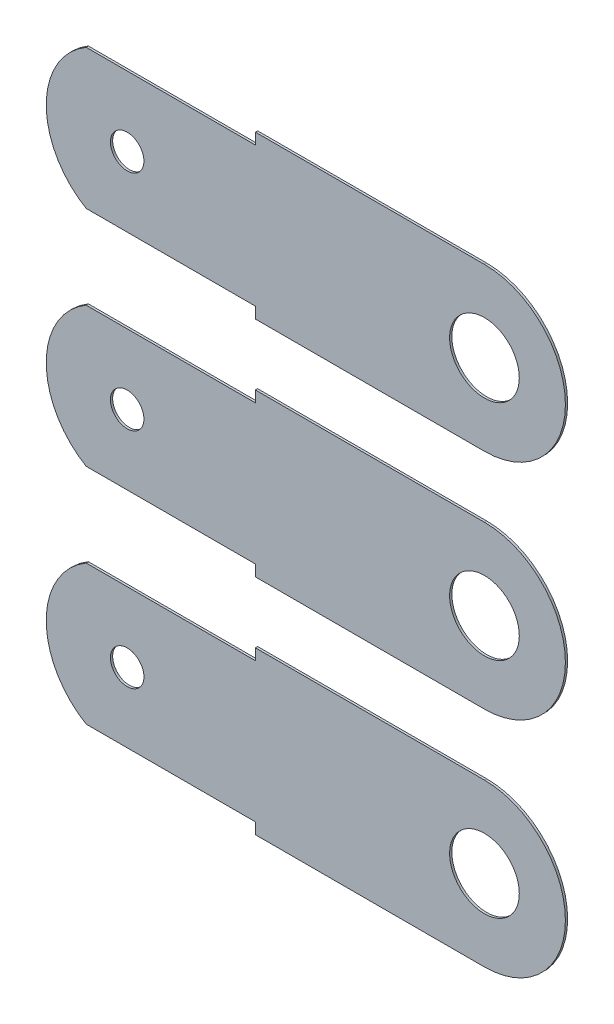
ISO-10303-21;
HEADER;
FILE_DESCRIPTION(('STEP AP214'),'2;1');
FILE_NAME('part.step','',(''),(''),'','','');
FILE_SCHEMA(('AUTOMOTIVE_DESIGN { 1 0 10303 214 1 1 1 1 }'));
ENDSEC;
DATA;
#1=APPLICATION_CONTEXT('core data for automotive mechanical design processes');
#2=APPLICATION_PROTOCOL_DEFINITION('international standard','automotive_design',2000,#1);
#3=PRODUCT_CONTEXT('',#1,'mechanical');
#4=PRODUCT('Part','Part','',(#3));
#5=PRODUCT_RELATED_PRODUCT_CATEGORY('part','',(#4));
#6=PRODUCT_DEFINITION_FORMATION('','',#4);
#7=PRODUCT_DEFINITION_CONTEXT('part definition',#1,'design');
#8=PRODUCT_DEFINITION('design','',#6,#7);
#9=PRODUCT_DEFINITION_SHAPE('','',#8);
#10=(LENGTH_UNIT() NAMED_UNIT(*) SI_UNIT(.MILLI.,.METRE.));
#11=(NAMED_UNIT(*) PLANE_ANGLE_UNIT() SI_UNIT($,.RADIAN.));
#12=(NAMED_UNIT(*) SI_UNIT($,.STERADIAN.) SOLID_ANGLE_UNIT());
#13=UNCERTAINTY_MEASURE_WITH_UNIT(LENGTH_MEASURE(1.E-05),#10,'distance_accuracy_value','');
#14=(GEOMETRIC_REPRESENTATION_CONTEXT(3) GLOBAL_UNCERTAINTY_ASSIGNED_CONTEXT((#13)) GLOBAL_UNIT_ASSIGNED_CONTEXT((#10,
#11,#12)) REPRESENTATION_CONTEXT('',''));
#15=CARTESIAN_POINT('',(0.,0.,0.));
#16=DIRECTION('',(0.,0.,1.));
#17=DIRECTION('',(1.,0.,0.));
#18=AXIS2_PLACEMENT_3D('',#15,#16,#17);
#19=CARTESIAN_POINT('',(-9.906,-5.08,0.0508));
#20=DIRECTION('',(0.,0.,1.));
#21=DIRECTION('',(1.,0.,0.));
#22=AXIS2_PLACEMENT_3D('',#19,#20,#21);
#23=PLANE('',#22);
#24=DIRECTION('',(0.,1.,0.));
#25=VECTOR('',#24,1.);
#26=CARTESIAN_POINT('',(-15.1194460576051,-6.6675,0.0508));
#27=LINE('',#26,#25);
#28=CARTESIAN_POINT('',(-15.1194460576051,-6.9215,0.0508));
#29=VERTEX_POINT('',#28);
#30=CARTESIAN_POINT('',(-15.1194460576051,-6.6675,0.0508));
#31=VERTEX_POINT('',#30);
#32=EDGE_CURVE('E110',#29,#31,#27,.T.);
#33=ORIENTED_EDGE('',*,*,#32,.F.);
#34=DIRECTION('',(1.,0.,0.));
#35=VECTOR('',#34,1.);
#36=CARTESIAN_POINT('',(-9.906,-6.9215,0.0508));
#37=LINE('',#36,#35);
#38=CARTESIAN_POINT('',(-9.906,-6.9215,0.0508));
#39=VERTEX_POINT('',#38);
#40=EDGE_CURVE('E164',#29,#39,#37,.T.);
#41=ORIENTED_EDGE('',*,*,#40,.T.);
#42=CARTESIAN_POINT('',(-9.906,-5.08,0.0508));
#43=DIRECTION('',(0.,0.,1.));
#44=DIRECTION('',(1.,0.,0.));
#45=AXIS2_PLACEMENT_3D('',#42,#43,#44);
#46=CIRCLE('',#45,1.8415);
#47=CARTESIAN_POINT('',(-9.906,-3.2385,0.0508));
#48=VERTEX_POINT('',#47);
#49=EDGE_CURVE('E155',#39,#48,#46,.T.);
#50=ORIENTED_EDGE('',*,*,#49,.T.);
#51=DIRECTION('',(-1.,0.,0.));
#52=VECTOR('',#51,1.);
#53=CARTESIAN_POINT('',(-9.906,-3.2385,0.0508));
#54=LINE('',#53,#52);
#55=CARTESIAN_POINT('',(-15.1174161513952,-3.2385,0.0508));
#56=VERTEX_POINT('',#55);
#57=EDGE_CURVE('E158',#48,#56,#54,.T.);
#58=ORIENTED_EDGE('',*,*,#57,.T.);
#59=DIRECTION('',(0.,1.,0.));
#60=VECTOR('',#59,1.);
#61=CARTESIAN_POINT('',(-15.1174161513952,-2.78009606813962,0.0508));
#62=LINE('',#61,#60);
#63=CARTESIAN_POINT('',(-15.1174161513952,-3.4925,0.0508));
#64=VERTEX_POINT('',#63);
#65=EDGE_CURVE('E134',#64,#56,#62,.T.);
#66=ORIENTED_EDGE('',*,*,#65,.F.);
#67=DIRECTION('',(1.,0.,0.));
#68=VECTOR('',#67,1.);
#69=CARTESIAN_POINT('',(-15.1174161513952,-3.4925,0.0508));
#70=LINE('',#69,#68);
#71=CARTESIAN_POINT('',(-18.9672555920004,-3.4925,0.0508));
#72=VERTEX_POINT('',#71);
#73=EDGE_CURVE('E113',#72,#64,#70,.T.);
#74=ORIENTED_EDGE('',*,*,#73,.F.);
#75=CARTESIAN_POINT('',(-18.034,-5.08,0.0508));
#76=DIRECTION('',(0.,0.,1.));
#77=DIRECTION('',(1.,0.,0.));
#78=AXIS2_PLACEMENT_3D('',#75,#76,#77);
#79=CIRCLE('',#78,1.8415);
#80=CARTESIAN_POINT('',(-18.9672555920004,-6.6675,0.0508));
#81=VERTEX_POINT('',#80);
#82=EDGE_CURVE('E161',#72,#81,#79,.T.);
#83=ORIENTED_EDGE('',*,*,#82,.T.);
#84=DIRECTION('',(-1.,0.,0.));
#85=VECTOR('',#84,1.);
#86=CARTESIAN_POINT('',(-15.1194460576051,-6.6675,0.0508));
#87=LINE('',#86,#85);
#88=EDGE_CURVE('E127',#31,#81,#87,.T.);
#89=ORIENTED_EDGE('',*,*,#88,.F.);
#90=EDGE_LOOP('',(#33,#41,#50,#58,#66,#74,#83,#89));
#91=FACE_BOUND('',#90,.T.);
#92=CARTESIAN_POINT('',(-18.034,-5.08,0.0508));
#93=DIRECTION('',(0.,0.,1.));
#94=DIRECTION('',(1.,0.,0.));
#95=AXIS2_PLACEMENT_3D('',#92,#93,#94);
#96=CIRCLE('',#95,0.380999999999998);
#97=CARTESIAN_POINT('',(-17.653,-5.08,0.0508));
#98=VERTEX_POINT('',#97);
#99=EDGE_CURVE('E149',#98,#98,#96,.T.);
#100=ORIENTED_EDGE('',*,*,#99,.F.);
#101=EDGE_LOOP('',(#100));
#102=FACE_BOUND('',#101,.T.);
#103=CARTESIAN_POINT('',(-9.906,-5.08,0.0508));
#104=DIRECTION('',(0.,0.,1.));
#105=DIRECTION('',(1.,0.,0.));
#106=AXIS2_PLACEMENT_3D('',#103,#104,#105);
#107=CIRCLE('',#106,0.79248);
#108=CARTESIAN_POINT('',(-9.11352,-5.08,0.0508));
#109=VERTEX_POINT('',#108);
#110=EDGE_CURVE('E143',#109,#109,#107,.T.);
#111=ORIENTED_EDGE('',*,*,#110,.F.);
#112=EDGE_LOOP('',(#111));
#113=FACE_BOUND('',#112,.T.);
#114=ADVANCED_FACE('F43',(#91,#102,#113),#23,.T.);
#115=CARTESIAN_POINT('',(-9.906,-5.08,0.));
#116=DIRECTION('',(0.,0.,1.));
#117=DIRECTION('',(1.,0.,0.));
#118=AXIS2_PLACEMENT_3D('',#115,#116,#117);
#119=PLANE('',#118);
#120=DIRECTION('',(1.,0.,0.));
#121=VECTOR('',#120,1.);
#122=CARTESIAN_POINT('',(-9.906,-6.9215,0.));
#123=LINE('',#122,#121);
#124=CARTESIAN_POINT('',(-15.1194460576051,-6.9215,0.));
#125=VERTEX_POINT('',#124);
#126=CARTESIAN_POINT('',(-9.906,-6.9215,0.));
#127=VERTEX_POINT('',#126);
#128=EDGE_CURVE('E126',#125,#127,#123,.T.);
#129=ORIENTED_EDGE('',*,*,#128,.F.);
#130=DIRECTION('',(0.,1.,0.));
#131=VECTOR('',#130,1.);
#132=CARTESIAN_POINT('',(-15.1194460576051,-6.6675,0.));
#133=LINE('',#132,#131);
#134=CARTESIAN_POINT('',(-15.1194460576051,-6.6675,0.));
#135=VERTEX_POINT('',#134);
#136=EDGE_CURVE('E58',#125,#135,#133,.T.);
#137=ORIENTED_EDGE('',*,*,#136,.T.);
#138=DIRECTION('',(-1.,0.,0.));
#139=VECTOR('',#138,1.);
#140=CARTESIAN_POINT('',(-15.1194460576051,-6.6675,0.));
#141=LINE('',#140,#139);
#142=CARTESIAN_POINT('',(-18.9672555920004,-6.6675,0.));
#143=VERTEX_POINT('',#142);
#144=EDGE_CURVE('E114',#135,#143,#141,.T.);
#145=ORIENTED_EDGE('',*,*,#144,.T.);
#146=CARTESIAN_POINT('',(-18.034,-5.08,0.));
#147=DIRECTION('',(0.,0.,1.));
#148=DIRECTION('',(1.,0.,0.));
#149=AXIS2_PLACEMENT_3D('',#146,#147,#148);
#150=CIRCLE('',#149,1.8415);
#151=CARTESIAN_POINT('',(-18.9672555920004,-3.4925,0.));
#152=VERTEX_POINT('',#151);
#153=EDGE_CURVE('E172',#152,#143,#150,.T.);
#154=ORIENTED_EDGE('',*,*,#153,.F.);
#155=DIRECTION('',(1.,0.,0.));
#156=VECTOR('',#155,1.);
#157=CARTESIAN_POINT('',(-15.1174161513952,-3.4925,0.));
#158=LINE('',#157,#156);
#159=CARTESIAN_POINT('',(-15.1174161513952,-3.4925,0.));
#160=VERTEX_POINT('',#159);
#161=EDGE_CURVE('E66',#152,#160,#158,.T.);
#162=ORIENTED_EDGE('',*,*,#161,.T.);
#163=DIRECTION('',(0.,1.,0.));
#164=VECTOR('',#163,1.);
#165=CARTESIAN_POINT('',(-15.1174161513952,-2.78009606813962,0.));
#166=LINE('',#165,#164);
#167=CARTESIAN_POINT('',(-15.1174161513952,-3.2385,0.));
#168=VERTEX_POINT('',#167);
#169=EDGE_CURVE('E133',#160,#168,#166,.T.);
#170=ORIENTED_EDGE('',*,*,#169,.T.);
#171=DIRECTION('',(-1.,0.,0.));
#172=VECTOR('',#171,1.);
#173=CARTESIAN_POINT('',(-9.906,-3.2385,0.));
#174=LINE('',#173,#172);
#175=CARTESIAN_POINT('',(-9.906,-3.2385,0.));
#176=VERTEX_POINT('',#175);
#177=EDGE_CURVE('E169',#176,#168,#174,.T.);
#178=ORIENTED_EDGE('',*,*,#177,.F.);
#179=CARTESIAN_POINT('',(-9.906,-5.08,0.));
#180=DIRECTION('',(0.,0.,1.));
#181=DIRECTION('',(1.,0.,0.));
#182=AXIS2_PLACEMENT_3D('',#179,#180,#181);
#183=CIRCLE('',#182,1.8415);
#184=EDGE_CURVE('E152',#127,#176,#183,.T.);
#185=ORIENTED_EDGE('',*,*,#184,.F.);
#186=EDGE_LOOP('',(#129,#137,#145,#154,#162,#170,#178,#185));
#187=FACE_BOUND('',#186,.T.);
#188=CARTESIAN_POINT('',(-18.034,-5.08,0.));
#189=DIRECTION('',(0.,0.,1.));
#190=DIRECTION('',(1.,0.,0.));
#191=AXIS2_PLACEMENT_3D('',#188,#189,#190);
#192=CIRCLE('',#191,0.380999999999998);
#193=CARTESIAN_POINT('',(-17.653,-5.08,0.));
#194=VERTEX_POINT('',#193);
#195=EDGE_CURVE('E146',#194,#194,#192,.T.);
#196=ORIENTED_EDGE('',*,*,#195,.T.);
#197=EDGE_LOOP('',(#196));
#198=FACE_BOUND('',#197,.T.);
#199=CARTESIAN_POINT('',(-9.906,-5.08,0.));
#200=DIRECTION('',(0.,0.,1.));
#201=DIRECTION('',(1.,0.,0.));
#202=AXIS2_PLACEMENT_3D('',#199,#200,#201);
#203=CIRCLE('',#202,0.79248);
#204=CARTESIAN_POINT('',(-9.11352,-5.08,0.));
#205=VERTEX_POINT('',#204);
#206=EDGE_CURVE('E142',#205,#205,#203,.T.);
#207=ORIENTED_EDGE('',*,*,#206,.T.);
#208=EDGE_LOOP('',(#207));
#209=FACE_BOUND('',#208,.T.);
#210=ADVANCED_FACE('F123',(#187,#198,#209),#119,.F.);
#211=CARTESIAN_POINT('',(-9.906,-5.08,0.0508));
#212=DIRECTION('',(0.,0.,-1.));
#213=DIRECTION('',(-1.,0.,0.));
#214=AXIS2_PLACEMENT_3D('',#211,#212,#213);
#215=CYLINDRICAL_SURFACE('',#214,1.8415);
#216=ORIENTED_EDGE('',*,*,#184,.T.);
#217=DIRECTION('',(0.,0.,-1.));
#218=VECTOR('',#217,1.);
#219=CARTESIAN_POINT('',(-9.906,-3.2385,0.0508));
#220=LINE('',#219,#218);
#221=EDGE_CURVE('E177',#48,#176,#220,.T.);
#222=ORIENTED_EDGE('',*,*,#221,.F.);
#223=ORIENTED_EDGE('',*,*,#49,.F.);
#224=DIRECTION('',(0.,0.,-1.));
#225=VECTOR('',#224,1.);
#226=CARTESIAN_POINT('',(-9.906,-6.9215,0.0508));
#227=LINE('',#226,#225);
#228=EDGE_CURVE('E166',#39,#127,#227,.T.);
#229=ORIENTED_EDGE('',*,*,#228,.T.);
#230=EDGE_LOOP('',(#216,#222,#223,#229));
#231=FACE_BOUND('',#230,.T.);
#232=ADVANCED_FACE('F45',(#231),#215,.T.);
#233=CARTESIAN_POINT('',(-9.906,-3.2385,0.0508));
#234=DIRECTION('',(0.,-1.,0.));
#235=DIRECTION('',(1.,0.,0.));
#236=AXIS2_PLACEMENT_3D('',#233,#234,#235);
#237=PLANE('',#236);
#238=ORIENTED_EDGE('',*,*,#177,.T.);
#239=DIRECTION('',(0.,0.,1.));
#240=VECTOR('',#239,1.);
#241=CARTESIAN_POINT('',(-15.1174161513952,-3.2385,0.0508));
#242=LINE('',#241,#240);
#243=EDGE_CURVE('E182',#168,#56,#242,.T.);
#244=ORIENTED_EDGE('',*,*,#243,.T.);
#245=ORIENTED_EDGE('',*,*,#57,.F.);
#246=ORIENTED_EDGE('',*,*,#221,.T.);
#247=EDGE_LOOP('',(#238,#244,#245,#246));
#248=FACE_BOUND('',#247,.T.);
#249=ADVANCED_FACE('F197',(#248),#237,.F.);
#250=CARTESIAN_POINT('',(-18.034,-5.08,0.0508));
#251=DIRECTION('',(0.,0.,-1.));
#252=DIRECTION('',(-1.,0.,0.));
#253=AXIS2_PLACEMENT_3D('',#250,#251,#252);
#254=CYLINDRICAL_SURFACE('',#253,1.8415);
#255=ORIENTED_EDGE('',*,*,#153,.T.);
#256=DIRECTION('',(0.,0.,-1.));
#257=VECTOR('',#256,1.);
#258=CARTESIAN_POINT('',(-18.9672555920004,-6.6675,0.0508));
#259=LINE('',#258,#257);
#260=EDGE_CURVE('E12',#143,#81,#259,.F.);
#261=ORIENTED_EDGE('',*,*,#260,.T.);
#262=ORIENTED_EDGE('',*,*,#82,.F.);
#263=DIRECTION('',(0.,0.,-1.));
#264=VECTOR('',#263,1.);
#265=CARTESIAN_POINT('',(-18.9672555920004,-3.4925,0.0508));
#266=LINE('',#265,#264);
#267=EDGE_CURVE('E180',#72,#152,#266,.T.);
#268=ORIENTED_EDGE('',*,*,#267,.T.);
#269=EDGE_LOOP('',(#255,#261,#262,#268));
#270=FACE_BOUND('',#269,.T.);
#271=ADVANCED_FACE('F193',(#270),#254,.T.);
#272=CARTESIAN_POINT('',(-9.906,-6.9215,0.0508));
#273=DIRECTION('',(0.,1.,0.));
#274=DIRECTION('',(-1.,0.,0.));
#275=AXIS2_PLACEMENT_3D('',#272,#273,#274);
#276=PLANE('',#275);
#277=ORIENTED_EDGE('',*,*,#40,.F.);
#278=DIRECTION('',(0.,0.,-1.));
#279=VECTOR('',#278,1.);
#280=CARTESIAN_POINT('',(-15.1194460576051,-6.9215,0.0508));
#281=LINE('',#280,#279);
#282=EDGE_CURVE('E51',#29,#125,#281,.T.);
#283=ORIENTED_EDGE('',*,*,#282,.T.);
#284=ORIENTED_EDGE('',*,*,#128,.T.);
#285=ORIENTED_EDGE('',*,*,#228,.F.);
#286=EDGE_LOOP('',(#277,#283,#284,#285));
#287=FACE_BOUND('',#286,.T.);
#288=ADVANCED_FACE('F186',(#287),#276,.F.);
#289=CARTESIAN_POINT('',(-18.034,-5.08,0.0508));
#290=DIRECTION('',(0.,0.,-1.));
#291=DIRECTION('',(-1.,0.,0.));
#292=AXIS2_PLACEMENT_3D('',#289,#290,#291);
#293=CYLINDRICAL_SURFACE('',#292,0.380999999999998);
#294=ORIENTED_EDGE('',*,*,#99,.T.);
#295=EDGE_LOOP('',(#294));
#296=FACE_BOUND('',#295,.T.);
#297=ORIENTED_EDGE('',*,*,#195,.F.);
#298=EDGE_LOOP('',(#297));
#299=FACE_BOUND('',#298,.T.);
#300=ADVANCED_FACE('F221',(#296,#299),#293,.F.);
#301=CARTESIAN_POINT('',(-9.906,-5.08,0.0508));
#302=DIRECTION('',(0.,0.,-1.));
#303=DIRECTION('',(-1.,0.,0.));
#304=AXIS2_PLACEMENT_3D('',#301,#302,#303);
#305=CYLINDRICAL_SURFACE('',#304,0.79248);
#306=ORIENTED_EDGE('',*,*,#110,.T.);
#307=EDGE_LOOP('',(#306));
#308=FACE_BOUND('',#307,.T.);
#309=ORIENTED_EDGE('',*,*,#206,.F.);
#310=EDGE_LOOP('',(#309));
#311=FACE_BOUND('',#310,.T.);
#312=ADVANCED_FACE('F211',(#308,#311),#305,.F.);
#313=CARTESIAN_POINT('',(-15.1174161513952,-2.78009606813962,0.));
#314=DIRECTION('',(1.,0.,0.));
#315=DIRECTION('',(0.,0.,-1.));
#316=AXIS2_PLACEMENT_3D('',#313,#314,#315);
#317=PLANE('',#316);
#318=ORIENTED_EDGE('',*,*,#169,.F.);
#319=DIRECTION('',(0.,0.,1.));
#320=VECTOR('',#319,1.);
#321=CARTESIAN_POINT('',(-15.1174161513952,-3.4925,0.));
#322=LINE('',#321,#320);
#323=EDGE_CURVE('E137',#160,#64,#322,.T.);
#324=ORIENTED_EDGE('',*,*,#323,.T.);
#325=ORIENTED_EDGE('',*,*,#65,.T.);
#326=ORIENTED_EDGE('',*,*,#243,.F.);
#327=EDGE_LOOP('',(#318,#324,#325,#326));
#328=FACE_BOUND('',#327,.T.);
#329=ADVANCED_FACE('F202',(#328),#317,.F.);
#330=CARTESIAN_POINT('',(-15.1174161513952,-3.4925,0.));
#331=DIRECTION('',(0.,-1.,0.));
#332=DIRECTION('',(1.,0.,0.));
#333=AXIS2_PLACEMENT_3D('',#330,#331,#332);
#334=PLANE('',#333);
#335=ORIENTED_EDGE('',*,*,#73,.T.);
#336=ORIENTED_EDGE('',*,*,#323,.F.);
#337=ORIENTED_EDGE('',*,*,#161,.F.);
#338=ORIENTED_EDGE('',*,*,#267,.F.);
#339=EDGE_LOOP('',(#335,#336,#337,#338));
#340=FACE_BOUND('',#339,.T.);
#341=ADVANCED_FACE('F203',(#340),#334,.F.);
#342=CARTESIAN_POINT('',(-15.1194460576051,-6.6675,0.));
#343=DIRECTION('',(0.,1.,0.));
#344=DIRECTION('',(-1.,0.,0.));
#345=AXIS2_PLACEMENT_3D('',#342,#343,#344);
#346=PLANE('',#345);
#347=ORIENTED_EDGE('',*,*,#144,.F.);
#348=DIRECTION('',(0.,0.,1.));
#349=VECTOR('',#348,1.);
#350=CARTESIAN_POINT('',(-15.1194460576051,-6.6675,0.));
#351=LINE('',#350,#349);
#352=EDGE_CURVE('E106',#135,#31,#351,.T.);
#353=ORIENTED_EDGE('',*,*,#352,.T.);
#354=ORIENTED_EDGE('',*,*,#88,.T.);
#355=ORIENTED_EDGE('',*,*,#260,.F.);
#356=EDGE_LOOP('',(#347,#353,#354,#355));
#357=FACE_BOUND('',#356,.T.);
#358=ADVANCED_FACE('F117',(#357),#346,.F.);
#359=CARTESIAN_POINT('',(-15.1194460576051,-6.6675,0.));
#360=DIRECTION('',(1.,0.,0.));
#361=DIRECTION('',(0.,0.,-1.));
#362=AXIS2_PLACEMENT_3D('',#359,#360,#361);
#363=PLANE('',#362);
#364=ORIENTED_EDGE('',*,*,#32,.T.);
#365=ORIENTED_EDGE('',*,*,#352,.F.);
#366=ORIENTED_EDGE('',*,*,#136,.F.);
#367=ORIENTED_EDGE('',*,*,#282,.F.);
#368=EDGE_LOOP('',(#364,#365,#366,#367));
#369=FACE_BOUND('',#368,.T.);
#370=ADVANCED_FACE('F108',(#369),#363,.F.);
#371=CLOSED_SHELL('',(#114,#210,#232,#249,#271,#288,#300,#312,#329,#341,#358,#370));
#372=MANIFOLD_SOLID_BREP('B2',#371);
#373=CARTESIAN_POINT('',(-9.906,0.,0.0508));
#374=DIRECTION('',(0.,0.,1.));
#375=DIRECTION('',(1.,0.,0.));
#376=AXIS2_PLACEMENT_3D('',#373,#374,#375);
#377=PLANE('',#376);
#378=DIRECTION('',(0.,1.,0.));
#379=VECTOR('',#378,1.);
#380=CARTESIAN_POINT('',(-15.1194460576051,-1.5875,0.0508));
#381=LINE('',#380,#379);
#382=CARTESIAN_POINT('',(-15.1194460576051,-1.8415,0.0508));
#383=VERTEX_POINT('',#382);
#384=CARTESIAN_POINT('',(-15.1194460576051,-1.5875,0.0508));
#385=VERTEX_POINT('',#384);
#386=EDGE_CURVE('E388',#383,#385,#381,.T.);
#387=ORIENTED_EDGE('',*,*,#386,.F.);
#388=DIRECTION('',(1.,0.,0.));
#389=VECTOR('',#388,1.);
#390=CARTESIAN_POINT('',(-9.906,-1.8415,0.0508));
#391=LINE('',#390,#389);
#392=CARTESIAN_POINT('',(-9.906,-1.8415,0.0508));
#393=VERTEX_POINT('',#392);
#394=EDGE_CURVE('E442',#383,#393,#391,.T.);
#395=ORIENTED_EDGE('',*,*,#394,.T.);
#396=CARTESIAN_POINT('',(-9.906,0.,0.0508));
#397=DIRECTION('',(0.,0.,1.));
#398=DIRECTION('',(1.,0.,0.));
#399=AXIS2_PLACEMENT_3D('',#396,#397,#398);
#400=CIRCLE('',#399,1.8415);
#401=CARTESIAN_POINT('',(-9.906,1.8415,0.0508));
#402=VERTEX_POINT('',#401);
#403=EDGE_CURVE('E433',#393,#402,#400,.T.);
#404=ORIENTED_EDGE('',*,*,#403,.T.);
#405=DIRECTION('',(-1.,0.,0.));
#406=VECTOR('',#405,1.);
#407=CARTESIAN_POINT('',(-9.906,1.8415,0.0508));
#408=LINE('',#407,#406);
#409=CARTESIAN_POINT('',(-15.1174161513952,1.8415,0.0508));
#410=VERTEX_POINT('',#409);
#411=EDGE_CURVE('E436',#402,#410,#408,.T.);
#412=ORIENTED_EDGE('',*,*,#411,.T.);
#413=DIRECTION('',(0.,1.,0.));
#414=VECTOR('',#413,1.);
#415=CARTESIAN_POINT('',(-15.1174161513952,2.29990393186038,0.0508));
#416=LINE('',#415,#414);
#417=CARTESIAN_POINT('',(-15.1174161513952,1.5875,0.0508));
#418=VERTEX_POINT('',#417);
#419=EDGE_CURVE('E412',#418,#410,#416,.T.);
#420=ORIENTED_EDGE('',*,*,#419,.F.);
#421=DIRECTION('',(1.,0.,0.));
#422=VECTOR('',#421,1.);
#423=CARTESIAN_POINT('',(-15.1174161513952,1.5875,0.0508));
#424=LINE('',#423,#422);
#425=CARTESIAN_POINT('',(-18.9672555920004,1.5875,0.0508));
#426=VERTEX_POINT('',#425);
#427=EDGE_CURVE('E391',#426,#418,#424,.T.);
#428=ORIENTED_EDGE('',*,*,#427,.F.);
#429=CARTESIAN_POINT('',(-18.034,0.,0.0508));
#430=DIRECTION('',(0.,0.,1.));
#431=DIRECTION('',(1.,0.,0.));
#432=AXIS2_PLACEMENT_3D('',#429,#430,#431);
#433=CIRCLE('',#432,1.8415);
#434=CARTESIAN_POINT('',(-18.9672555920004,-1.5875,0.0508));
#435=VERTEX_POINT('',#434);
#436=EDGE_CURVE('E439',#426,#435,#433,.T.);
#437=ORIENTED_EDGE('',*,*,#436,.T.);
#438=DIRECTION('',(-1.,0.,0.));
#439=VECTOR('',#438,1.);
#440=CARTESIAN_POINT('',(-15.1194460576051,-1.5875,0.0508));
#441=LINE('',#440,#439);
#442=EDGE_CURVE('E405',#385,#435,#441,.T.);
#443=ORIENTED_EDGE('',*,*,#442,.F.);
#444=EDGE_LOOP('',(#387,#395,#404,#412,#420,#428,#437,#443));
#445=FACE_BOUND('',#444,.T.);
#446=CARTESIAN_POINT('',(-18.034,0.,0.0508));
#447=DIRECTION('',(0.,0.,1.));
#448=DIRECTION('',(1.,0.,0.));
#449=AXIS2_PLACEMENT_3D('',#446,#447,#448);
#450=CIRCLE('',#449,0.380999999999998);
#451=CARTESIAN_POINT('',(-17.653,0.,0.0508));
#452=VERTEX_POINT('',#451);
#453=EDGE_CURVE('E427',#452,#452,#450,.T.);
#454=ORIENTED_EDGE('',*,*,#453,.F.);
#455=EDGE_LOOP('',(#454));
#456=FACE_BOUND('',#455,.T.);
#457=CARTESIAN_POINT('',(-9.906,0.,0.0508));
#458=DIRECTION('',(0.,0.,1.));
#459=DIRECTION('',(1.,0.,0.));
#460=AXIS2_PLACEMENT_3D('',#457,#458,#459);
#461=CIRCLE('',#460,0.79248);
#462=CARTESIAN_POINT('',(-9.11352,0.,0.0508));
#463=VERTEX_POINT('',#462);
#464=EDGE_CURVE('E421',#463,#463,#461,.T.);
#465=ORIENTED_EDGE('',*,*,#464,.F.);
#466=EDGE_LOOP('',(#465));
#467=FACE_BOUND('',#466,.T.);
#468=ADVANCED_FACE('F321',(#445,#456,#467),#377,.T.);
#469=CARTESIAN_POINT('',(-9.906,0.,0.));
#470=DIRECTION('',(0.,0.,1.));
#471=DIRECTION('',(1.,0.,0.));
#472=AXIS2_PLACEMENT_3D('',#469,#470,#471);
#473=PLANE('',#472);
#474=DIRECTION('',(1.,0.,0.));
#475=VECTOR('',#474,1.);
#476=CARTESIAN_POINT('',(-9.906,-1.8415,0.));
#477=LINE('',#476,#475);
#478=CARTESIAN_POINT('',(-15.1194460576051,-1.8415,0.));
#479=VERTEX_POINT('',#478);
#480=CARTESIAN_POINT('',(-9.906,-1.8415,0.));
#481=VERTEX_POINT('',#480);
#482=EDGE_CURVE('E404',#479,#481,#477,.T.);
#483=ORIENTED_EDGE('',*,*,#482,.F.);
#484=DIRECTION('',(0.,1.,0.));
#485=VECTOR('',#484,1.);
#486=CARTESIAN_POINT('',(-15.1194460576051,-1.5875,0.));
#487=LINE('',#486,#485);
#488=CARTESIAN_POINT('',(-15.1194460576051,-1.5875,0.));
#489=VERTEX_POINT('',#488);
#490=EDGE_CURVE('E336',#479,#489,#487,.T.);
#491=ORIENTED_EDGE('',*,*,#490,.T.);
#492=DIRECTION('',(-1.,0.,0.));
#493=VECTOR('',#492,1.);
#494=CARTESIAN_POINT('',(-15.1194460576051,-1.5875,0.));
#495=LINE('',#494,#493);
#496=CARTESIAN_POINT('',(-18.9672555920004,-1.5875,0.));
#497=VERTEX_POINT('',#496);
#498=EDGE_CURVE('E392',#489,#497,#495,.T.);
#499=ORIENTED_EDGE('',*,*,#498,.T.);
#500=CARTESIAN_POINT('',(-18.034,0.,0.));
#501=DIRECTION('',(0.,0.,1.));
#502=DIRECTION('',(1.,0.,0.));
#503=AXIS2_PLACEMENT_3D('',#500,#501,#502);
#504=CIRCLE('',#503,1.8415);
#505=CARTESIAN_POINT('',(-18.9672555920004,1.5875,0.));
#506=VERTEX_POINT('',#505);
#507=EDGE_CURVE('E450',#506,#497,#504,.T.);
#508=ORIENTED_EDGE('',*,*,#507,.F.);
#509=DIRECTION('',(1.,0.,0.));
#510=VECTOR('',#509,1.);
#511=CARTESIAN_POINT('',(-15.1174161513952,1.5875,0.));
#512=LINE('',#511,#510);
#513=CARTESIAN_POINT('',(-15.1174161513952,1.5875,0.));
#514=VERTEX_POINT('',#513);
#515=EDGE_CURVE('E344',#506,#514,#512,.T.);
#516=ORIENTED_EDGE('',*,*,#515,.T.);
#517=DIRECTION('',(0.,1.,0.));
#518=VECTOR('',#517,1.);
#519=CARTESIAN_POINT('',(-15.1174161513952,2.29990393186038,0.));
#520=LINE('',#519,#518);
#521=CARTESIAN_POINT('',(-15.1174161513952,1.8415,0.));
#522=VERTEX_POINT('',#521);
#523=EDGE_CURVE('E411',#514,#522,#520,.T.);
#524=ORIENTED_EDGE('',*,*,#523,.T.);
#525=DIRECTION('',(-1.,0.,0.));
#526=VECTOR('',#525,1.);
#527=CARTESIAN_POINT('',(-9.906,1.8415,0.));
#528=LINE('',#527,#526);
#529=CARTESIAN_POINT('',(-9.906,1.8415,0.));
#530=VERTEX_POINT('',#529);
#531=EDGE_CURVE('E447',#530,#522,#528,.T.);
#532=ORIENTED_EDGE('',*,*,#531,.F.);
#533=CARTESIAN_POINT('',(-9.906,0.,0.));
#534=DIRECTION('',(0.,0.,1.));
#535=DIRECTION('',(1.,0.,0.));
#536=AXIS2_PLACEMENT_3D('',#533,#534,#535);
#537=CIRCLE('',#536,1.8415);
#538=EDGE_CURVE('E430',#481,#530,#537,.T.);
#539=ORIENTED_EDGE('',*,*,#538,.F.);
#540=EDGE_LOOP('',(#483,#491,#499,#508,#516,#524,#532,#539));
#541=FACE_BOUND('',#540,.T.);
#542=CARTESIAN_POINT('',(-18.034,0.,0.));
#543=DIRECTION('',(0.,0.,1.));
#544=DIRECTION('',(1.,0.,0.));
#545=AXIS2_PLACEMENT_3D('',#542,#543,#544);
#546=CIRCLE('',#545,0.380999999999998);
#547=CARTESIAN_POINT('',(-17.653,0.,0.));
#548=VERTEX_POINT('',#547);
#549=EDGE_CURVE('E424',#548,#548,#546,.T.);
#550=ORIENTED_EDGE('',*,*,#549,.T.);
#551=EDGE_LOOP('',(#550));
#552=FACE_BOUND('',#551,.T.);
#553=CARTESIAN_POINT('',(-9.906,0.,0.));
#554=DIRECTION('',(0.,0.,1.));
#555=DIRECTION('',(1.,0.,0.));
#556=AXIS2_PLACEMENT_3D('',#553,#554,#555);
#557=CIRCLE('',#556,0.79248);
#558=CARTESIAN_POINT('',(-9.11352,0.,0.));
#559=VERTEX_POINT('',#558);
#560=EDGE_CURVE('E420',#559,#559,#557,.T.);
#561=ORIENTED_EDGE('',*,*,#560,.T.);
#562=EDGE_LOOP('',(#561));
#563=FACE_BOUND('',#562,.T.);
#564=ADVANCED_FACE('F401',(#541,#552,#563),#473,.F.);
#565=CARTESIAN_POINT('',(-9.906,0.,0.0508));
#566=DIRECTION('',(0.,0.,-1.));
#567=DIRECTION('',(-1.,0.,0.));
#568=AXIS2_PLACEMENT_3D('',#565,#566,#567);
#569=CYLINDRICAL_SURFACE('',#568,1.8415);
#570=ORIENTED_EDGE('',*,*,#538,.T.);
#571=DIRECTION('',(0.,0.,-1.));
#572=VECTOR('',#571,1.);
#573=CARTESIAN_POINT('',(-9.906,1.8415,0.0508));
#574=LINE('',#573,#572);
#575=EDGE_CURVE('E455',#402,#530,#574,.T.);
#576=ORIENTED_EDGE('',*,*,#575,.F.);
#577=ORIENTED_EDGE('',*,*,#403,.F.);
#578=DIRECTION('',(0.,0.,-1.));
#579=VECTOR('',#578,1.);
#580=CARTESIAN_POINT('',(-9.906,-1.8415,0.0508));
#581=LINE('',#580,#579);
#582=EDGE_CURVE('E444',#393,#481,#581,.T.);
#583=ORIENTED_EDGE('',*,*,#582,.T.);
#584=EDGE_LOOP('',(#570,#576,#577,#583));
#585=FACE_BOUND('',#584,.T.);
#586=ADVANCED_FACE('F323',(#585),#569,.T.);
#587=CARTESIAN_POINT('',(-9.906,1.8415,0.0508));
#588=DIRECTION('',(0.,-1.,0.));
#589=DIRECTION('',(1.,0.,0.));
#590=AXIS2_PLACEMENT_3D('',#587,#588,#589);
#591=PLANE('',#590);
#592=ORIENTED_EDGE('',*,*,#531,.T.);
#593=DIRECTION('',(0.,0.,1.));
#594=VECTOR('',#593,1.);
#595=CARTESIAN_POINT('',(-15.1174161513952,1.8415,0.0508));
#596=LINE('',#595,#594);
#597=EDGE_CURVE('E460',#522,#410,#596,.T.);
#598=ORIENTED_EDGE('',*,*,#597,.T.);
#599=ORIENTED_EDGE('',*,*,#411,.F.);
#600=ORIENTED_EDGE('',*,*,#575,.T.);
#601=EDGE_LOOP('',(#592,#598,#599,#600));
#602=FACE_BOUND('',#601,.T.);
#603=ADVANCED_FACE('F475',(#602),#591,.F.);
#604=CARTESIAN_POINT('',(-18.034,0.,0.0508));
#605=DIRECTION('',(0.,0.,-1.));
#606=DIRECTION('',(-1.,0.,0.));
#607=AXIS2_PLACEMENT_3D('',#604,#605,#606);
#608=CYLINDRICAL_SURFACE('',#607,1.8415);
#609=ORIENTED_EDGE('',*,*,#507,.T.);
#610=DIRECTION('',(0.,0.,-1.));
#611=VECTOR('',#610,1.);
#612=CARTESIAN_POINT('',(-18.9672555920004,-1.5875,0.0508));
#613=LINE('',#612,#611);
#614=EDGE_CURVE('E41',#497,#435,#613,.F.);
#615=ORIENTED_EDGE('',*,*,#614,.T.);
#616=ORIENTED_EDGE('',*,*,#436,.F.);
#617=DIRECTION('',(0.,0.,-1.));
#618=VECTOR('',#617,1.);
#619=CARTESIAN_POINT('',(-18.9672555920004,1.5875,0.0508));
#620=LINE('',#619,#618);
#621=EDGE_CURVE('E458',#426,#506,#620,.T.);
#622=ORIENTED_EDGE('',*,*,#621,.T.);
#623=EDGE_LOOP('',(#609,#615,#616,#622));
#624=FACE_BOUND('',#623,.T.);
#625=ADVANCED_FACE('F471',(#624),#608,.T.);
#626=CARTESIAN_POINT('',(-9.906,-1.8415,0.0508));
#627=DIRECTION('',(0.,1.,0.));
#628=DIRECTION('',(-1.,0.,0.));
#629=AXIS2_PLACEMENT_3D('',#626,#627,#628);
#630=PLANE('',#629);
#631=ORIENTED_EDGE('',*,*,#394,.F.);
#632=DIRECTION('',(0.,0.,-1.));
#633=VECTOR('',#632,1.);
#634=CARTESIAN_POINT('',(-15.1194460576051,-1.8415,0.0508));
#635=LINE('',#634,#633);
#636=EDGE_CURVE('E329',#383,#479,#635,.T.);
#637=ORIENTED_EDGE('',*,*,#636,.T.);
#638=ORIENTED_EDGE('',*,*,#482,.T.);
#639=ORIENTED_EDGE('',*,*,#582,.F.);
#640=EDGE_LOOP('',(#631,#637,#638,#639));
#641=FACE_BOUND('',#640,.T.);
#642=ADVANCED_FACE('F464',(#641),#630,.F.);
#643=CARTESIAN_POINT('',(-18.034,0.,0.0508));
#644=DIRECTION('',(0.,0.,-1.));
#645=DIRECTION('',(-1.,0.,0.));
#646=AXIS2_PLACEMENT_3D('',#643,#644,#645);
#647=CYLINDRICAL_SURFACE('',#646,0.380999999999998);
#648=ORIENTED_EDGE('',*,*,#453,.T.);
#649=EDGE_LOOP('',(#648));
#650=FACE_BOUND('',#649,.T.);
#651=ORIENTED_EDGE('',*,*,#549,.F.);
#652=EDGE_LOOP('',(#651));
#653=FACE_BOUND('',#652,.T.);
#654=ADVANCED_FACE('F499',(#650,#653),#647,.F.);
#655=CARTESIAN_POINT('',(-9.906,0.,0.0508));
#656=DIRECTION('',(0.,0.,-1.));
#657=DIRECTION('',(-1.,0.,0.));
#658=AXIS2_PLACEMENT_3D('',#655,#656,#657);
#659=CYLINDRICAL_SURFACE('',#658,0.79248);
#660=ORIENTED_EDGE('',*,*,#464,.T.);
#661=EDGE_LOOP('',(#660));
#662=FACE_BOUND('',#661,.T.);
#663=ORIENTED_EDGE('',*,*,#560,.F.);
#664=EDGE_LOOP('',(#663));
#665=FACE_BOUND('',#664,.T.);
#666=ADVANCED_FACE('F489',(#662,#665),#659,.F.);
#667=CARTESIAN_POINT('',(-15.1174161513952,2.29990393186038,0.));
#668=DIRECTION('',(1.,0.,0.));
#669=DIRECTION('',(0.,0.,-1.));
#670=AXIS2_PLACEMENT_3D('',#667,#668,#669);
#671=PLANE('',#670);
#672=ORIENTED_EDGE('',*,*,#523,.F.);
#673=DIRECTION('',(0.,0.,1.));
#674=VECTOR('',#673,1.);
#675=CARTESIAN_POINT('',(-15.1174161513952,1.5875,0.));
#676=LINE('',#675,#674);
#677=EDGE_CURVE('E415',#514,#418,#676,.T.);
#678=ORIENTED_EDGE('',*,*,#677,.T.);
#679=ORIENTED_EDGE('',*,*,#419,.T.);
#680=ORIENTED_EDGE('',*,*,#597,.F.);
#681=EDGE_LOOP('',(#672,#678,#679,#680));
#682=FACE_BOUND('',#681,.T.);
#683=ADVANCED_FACE('F480',(#682),#671,.F.);
#684=CARTESIAN_POINT('',(-15.1174161513952,1.5875,0.));
#685=DIRECTION('',(0.,-1.,0.));
#686=DIRECTION('',(1.,0.,0.));
#687=AXIS2_PLACEMENT_3D('',#684,#685,#686);
#688=PLANE('',#687);
#689=ORIENTED_EDGE('',*,*,#427,.T.);
#690=ORIENTED_EDGE('',*,*,#677,.F.);
#691=ORIENTED_EDGE('',*,*,#515,.F.);
#692=ORIENTED_EDGE('',*,*,#621,.F.);
#693=EDGE_LOOP('',(#689,#690,#691,#692));
#694=FACE_BOUND('',#693,.T.);
#695=ADVANCED_FACE('F481',(#694),#688,.F.);
#696=CARTESIAN_POINT('',(-15.1194460576051,-1.5875,0.));
#697=DIRECTION('',(0.,1.,0.));
#698=DIRECTION('',(-1.,0.,0.));
#699=AXIS2_PLACEMENT_3D('',#696,#697,#698);
#700=PLANE('',#699);
#701=ORIENTED_EDGE('',*,*,#498,.F.);
#702=DIRECTION('',(0.,0.,1.));
#703=VECTOR('',#702,1.);
#704=CARTESIAN_POINT('',(-15.1194460576051,-1.5875,0.));
#705=LINE('',#704,#703);
#706=EDGE_CURVE('E384',#489,#385,#705,.T.);
#707=ORIENTED_EDGE('',*,*,#706,.T.);
#708=ORIENTED_EDGE('',*,*,#442,.T.);
#709=ORIENTED_EDGE('',*,*,#614,.F.);
#710=EDGE_LOOP('',(#701,#707,#708,#709));
#711=FACE_BOUND('',#710,.T.);
#712=ADVANCED_FACE('F395',(#711),#700,.F.);
#713=CARTESIAN_POINT('',(-15.1194460576051,-1.5875,0.));
#714=DIRECTION('',(1.,0.,0.));
#715=DIRECTION('',(0.,0.,-1.));
#716=AXIS2_PLACEMENT_3D('',#713,#714,#715);
#717=PLANE('',#716);
#718=ORIENTED_EDGE('',*,*,#386,.T.);
#719=ORIENTED_EDGE('',*,*,#706,.F.);
#720=ORIENTED_EDGE('',*,*,#490,.F.);
#721=ORIENTED_EDGE('',*,*,#636,.F.);
#722=EDGE_LOOP('',(#718,#719,#720,#721));
#723=FACE_BOUND('',#722,.T.);
#724=ADVANCED_FACE('F386',(#723),#717,.F.);
#725=CLOSED_SHELL('',(#468,#564,#586,#603,#625,#642,#654,#666,#683,#695,#712,#724));
#726=MANIFOLD_SOLID_BREP('B6',#725);
#727=CARTESIAN_POINT('',(-9.906,5.08,0.0508));
#728=DIRECTION('',(0.,0.,1.));
#729=DIRECTION('',(1.,0.,0.));
#730=AXIS2_PLACEMENT_3D('',#727,#728,#729);
#731=PLANE('',#730);
#732=DIRECTION('',(0.,1.,0.));
#733=VECTOR('',#732,1.);
#734=CARTESIAN_POINT('',(-15.1194460576051,3.4925,0.0508));
#735=LINE('',#734,#733);
#736=CARTESIAN_POINT('',(-15.1194460576051,3.2385,0.0508));
#737=VERTEX_POINT('',#736);
#738=CARTESIAN_POINT('',(-15.1194460576051,3.4925,0.0508));
#739=VERTEX_POINT('',#738);
#740=EDGE_CURVE('E657',#737,#739,#735,.T.);
#741=ORIENTED_EDGE('',*,*,#740,.F.);
#742=DIRECTION('',(1.,0.,0.));
#743=VECTOR('',#742,1.);
#744=CARTESIAN_POINT('',(-9.906,3.2385,0.0508));
#745=LINE('',#744,#743);
#746=CARTESIAN_POINT('',(-9.906,3.2385,0.0508));
#747=VERTEX_POINT('',#746);
#748=EDGE_CURVE('E711',#737,#747,#745,.T.);
#749=ORIENTED_EDGE('',*,*,#748,.T.);
#750=CARTESIAN_POINT('',(-9.906,5.08,0.0508));
#751=DIRECTION('',(0.,0.,1.));
#752=DIRECTION('',(1.,0.,0.));
#753=AXIS2_PLACEMENT_3D('',#750,#751,#752);
#754=CIRCLE('',#753,1.8415);
#755=CARTESIAN_POINT('',(-9.906,6.9215,0.0508));
#756=VERTEX_POINT('',#755);
#757=EDGE_CURVE('E702',#747,#756,#754,.T.);
#758=ORIENTED_EDGE('',*,*,#757,.T.);
#759=DIRECTION('',(-1.,0.,0.));
#760=VECTOR('',#759,1.);
#761=CARTESIAN_POINT('',(-9.906,6.9215,0.0508));
#762=LINE('',#761,#760);
#763=CARTESIAN_POINT('',(-15.1174161513952,6.9215,0.0508));
#764=VERTEX_POINT('',#763);
#765=EDGE_CURVE('E705',#756,#764,#762,.T.);
#766=ORIENTED_EDGE('',*,*,#765,.T.);
#767=DIRECTION('',(0.,1.,0.));
#768=VECTOR('',#767,1.);
#769=CARTESIAN_POINT('',(-15.1174161513952,7.37990393186038,0.0508));
#770=LINE('',#769,#768);
#771=CARTESIAN_POINT('',(-15.1174161513952,6.6675,0.0508));
#772=VERTEX_POINT('',#771);
#773=EDGE_CURVE('E681',#772,#764,#770,.T.);
#774=ORIENTED_EDGE('',*,*,#773,.F.);
#775=DIRECTION('',(1.,0.,0.));
#776=VECTOR('',#775,1.);
#777=CARTESIAN_POINT('',(-15.1174161513952,6.6675,0.0508));
#778=LINE('',#777,#776);
#779=CARTESIAN_POINT('',(-18.9672555920004,6.6675,0.0508));
#780=VERTEX_POINT('',#779);
#781=EDGE_CURVE('E660',#780,#772,#778,.T.);
#782=ORIENTED_EDGE('',*,*,#781,.F.);
#783=CARTESIAN_POINT('',(-18.034,5.08,0.0508));
#784=DIRECTION('',(0.,0.,1.));
#785=DIRECTION('',(1.,0.,0.));
#786=AXIS2_PLACEMENT_3D('',#783,#784,#785);
#787=CIRCLE('',#786,1.8415);
#788=CARTESIAN_POINT('',(-18.9672555920004,3.4925,0.0508));
#789=VERTEX_POINT('',#788);
#790=EDGE_CURVE('E708',#780,#789,#787,.T.);
#791=ORIENTED_EDGE('',*,*,#790,.T.);
#792=DIRECTION('',(-1.,0.,0.));
#793=VECTOR('',#792,1.);
#794=CARTESIAN_POINT('',(-15.1194460576051,3.4925,0.0508));
#795=LINE('',#794,#793);
#796=EDGE_CURVE('E674',#739,#789,#795,.T.);
#797=ORIENTED_EDGE('',*,*,#796,.F.);
#798=EDGE_LOOP('',(#741,#749,#758,#766,#774,#782,#791,#797));
#799=FACE_BOUND('',#798,.T.);
#800=CARTESIAN_POINT('',(-18.034,5.08,0.0508));
#801=DIRECTION('',(0.,0.,1.));
#802=DIRECTION('',(1.,0.,0.));
#803=AXIS2_PLACEMENT_3D('',#800,#801,#802);
#804=CIRCLE('',#803,0.380999999999998);
#805=CARTESIAN_POINT('',(-17.653,5.08,0.0508));
#806=VERTEX_POINT('',#805);
#807=EDGE_CURVE('E696',#806,#806,#804,.T.);
#808=ORIENTED_EDGE('',*,*,#807,.F.);
#809=EDGE_LOOP('',(#808));
#810=FACE_BOUND('',#809,.T.);
#811=CARTESIAN_POINT('',(-9.906,5.08,0.0508));
#812=DIRECTION('',(0.,0.,1.));
#813=DIRECTION('',(1.,0.,0.));
#814=AXIS2_PLACEMENT_3D('',#811,#812,#813);
#815=CIRCLE('',#814,0.79248);
#816=CARTESIAN_POINT('',(-9.11352,5.08,0.0508));
#817=VERTEX_POINT('',#816);
#818=EDGE_CURVE('E690',#817,#817,#815,.T.);
#819=ORIENTED_EDGE('',*,*,#818,.F.);
#820=EDGE_LOOP('',(#819));
#821=FACE_BOUND('',#820,.T.);
#822=ADVANCED_FACE('F590',(#799,#810,#821),#731,.T.);
#823=CARTESIAN_POINT('',(-9.906,5.08,0.));
#824=DIRECTION('',(0.,0.,1.));
#825=DIRECTION('',(1.,0.,0.));
#826=AXIS2_PLACEMENT_3D('',#823,#824,#825);
#827=PLANE('',#826);
#828=DIRECTION('',(1.,0.,0.));
#829=VECTOR('',#828,1.);
#830=CARTESIAN_POINT('',(-9.906,3.2385,0.));
#831=LINE('',#830,#829);
#832=CARTESIAN_POINT('',(-15.1194460576051,3.2385,0.));
#833=VERTEX_POINT('',#832);
#834=CARTESIAN_POINT('',(-9.906,3.2385,0.));
#835=VERTEX_POINT('',#834);
#836=EDGE_CURVE('E673',#833,#835,#831,.T.);
#837=ORIENTED_EDGE('',*,*,#836,.F.);
#838=DIRECTION('',(0.,1.,0.));
#839=VECTOR('',#838,1.);
#840=CARTESIAN_POINT('',(-15.1194460576051,3.4925,0.));
#841=LINE('',#840,#839);
#842=CARTESIAN_POINT('',(-15.1194460576051,3.4925,0.));
#843=VERTEX_POINT('',#842);
#844=EDGE_CURVE('E605',#833,#843,#841,.T.);
#845=ORIENTED_EDGE('',*,*,#844,.T.);
#846=DIRECTION('',(-1.,0.,0.));
#847=VECTOR('',#846,1.);
#848=CARTESIAN_POINT('',(-15.1194460576051,3.4925,0.));
#849=LINE('',#848,#847);
#850=CARTESIAN_POINT('',(-18.9672555920004,3.4925,0.));
#851=VERTEX_POINT('',#850);
#852=EDGE_CURVE('E661',#843,#851,#849,.T.);
#853=ORIENTED_EDGE('',*,*,#852,.T.);
#854=CARTESIAN_POINT('',(-18.034,5.08,0.));
#855=DIRECTION('',(0.,0.,1.));
#856=DIRECTION('',(1.,0.,0.));
#857=AXIS2_PLACEMENT_3D('',#854,#855,#856);
#858=CIRCLE('',#857,1.8415);
#859=CARTESIAN_POINT('',(-18.9672555920004,6.6675,0.));
#860=VERTEX_POINT('',#859);
#861=EDGE_CURVE('E719',#860,#851,#858,.T.);
#862=ORIENTED_EDGE('',*,*,#861,.F.);
#863=DIRECTION('',(1.,0.,0.));
#864=VECTOR('',#863,1.);
#865=CARTESIAN_POINT('',(-15.1174161513952,6.6675,0.));
#866=LINE('',#865,#864);
#867=CARTESIAN_POINT('',(-15.1174161513952,6.6675,0.));
#868=VERTEX_POINT('',#867);
#869=EDGE_CURVE('E613',#860,#868,#866,.T.);
#870=ORIENTED_EDGE('',*,*,#869,.T.);
#871=DIRECTION('',(0.,1.,0.));
#872=VECTOR('',#871,1.);
#873=CARTESIAN_POINT('',(-15.1174161513952,7.37990393186038,0.));
#874=LINE('',#873,#872);
#875=CARTESIAN_POINT('',(-15.1174161513952,6.9215,0.));
#876=VERTEX_POINT('',#875);
#877=EDGE_CURVE('E680',#868,#876,#874,.T.);
#878=ORIENTED_EDGE('',*,*,#877,.T.);
#879=DIRECTION('',(-1.,0.,0.));
#880=VECTOR('',#879,1.);
#881=CARTESIAN_POINT('',(-9.906,6.9215,0.));
#882=LINE('',#881,#880);
#883=CARTESIAN_POINT('',(-9.906,6.9215,0.));
#884=VERTEX_POINT('',#883);
#885=EDGE_CURVE('E716',#884,#876,#882,.T.);
#886=ORIENTED_EDGE('',*,*,#885,.F.);
#887=CARTESIAN_POINT('',(-9.906,5.08,0.));
#888=DIRECTION('',(0.,0.,1.));
#889=DIRECTION('',(1.,0.,0.));
#890=AXIS2_PLACEMENT_3D('',#887,#888,#889);
#891=CIRCLE('',#890,1.8415);
#892=EDGE_CURVE('E699',#835,#884,#891,.T.);
#893=ORIENTED_EDGE('',*,*,#892,.F.);
#894=EDGE_LOOP('',(#837,#845,#853,#862,#870,#878,#886,#893));
#895=FACE_BOUND('',#894,.T.);
#896=CARTESIAN_POINT('',(-18.034,5.08,0.));
#897=DIRECTION('',(0.,0.,1.));
#898=DIRECTION('',(1.,0.,0.));
#899=AXIS2_PLACEMENT_3D('',#896,#897,#898);
#900=CIRCLE('',#899,0.380999999999998);
#901=CARTESIAN_POINT('',(-17.653,5.08,0.));
#902=VERTEX_POINT('',#901);
#903=EDGE_CURVE('E693',#902,#902,#900,.T.);
#904=ORIENTED_EDGE('',*,*,#903,.T.);
#905=EDGE_LOOP('',(#904));
#906=FACE_BOUND('',#905,.T.);
#907=CARTESIAN_POINT('',(-9.906,5.08,0.));
#908=DIRECTION('',(0.,0.,1.));
#909=DIRECTION('',(1.,0.,0.));
#910=AXIS2_PLACEMENT_3D('',#907,#908,#909);
#911=CIRCLE('',#910,0.79248);
#912=CARTESIAN_POINT('',(-9.11352,5.08,0.));
#913=VERTEX_POINT('',#912);
#914=EDGE_CURVE('E689',#913,#913,#911,.T.);
#915=ORIENTED_EDGE('',*,*,#914,.T.);
#916=EDGE_LOOP('',(#915));
#917=FACE_BOUND('',#916,.T.);
#918=ADVANCED_FACE('F670',(#895,#906,#917),#827,.F.);
#919=CARTESIAN_POINT('',(-9.906,5.08,0.0508));
#920=DIRECTION('',(0.,0.,-1.));
#921=DIRECTION('',(-1.,0.,0.));
#922=AXIS2_PLACEMENT_3D('',#919,#920,#921);
#923=CYLINDRICAL_SURFACE('',#922,1.8415);
#924=ORIENTED_EDGE('',*,*,#892,.T.);
#925=DIRECTION('',(0.,0.,-1.));
#926=VECTOR('',#925,1.);
#927=CARTESIAN_POINT('',(-9.906,6.9215,0.0508));
#928=LINE('',#927,#926);
#929=EDGE_CURVE('E724',#756,#884,#928,.T.);
#930=ORIENTED_EDGE('',*,*,#929,.F.);
#931=ORIENTED_EDGE('',*,*,#757,.F.);
#932=DIRECTION('',(0.,0.,-1.));
#933=VECTOR('',#932,1.);
#934=CARTESIAN_POINT('',(-9.906,3.2385,0.0508));
#935=LINE('',#934,#933);
#936=EDGE_CURVE('E713',#747,#835,#935,.T.);
#937=ORIENTED_EDGE('',*,*,#936,.T.);
#938=EDGE_LOOP('',(#924,#930,#931,#937));
#939=FACE_BOUND('',#938,.T.);
#940=ADVANCED_FACE('F592',(#939),#923,.T.);
#941=CARTESIAN_POINT('',(-9.906,6.9215,0.0508));
#942=DIRECTION('',(0.,-1.,0.));
#943=DIRECTION('',(1.,0.,0.));
#944=AXIS2_PLACEMENT_3D('',#941,#942,#943);
#945=PLANE('',#944);
#946=ORIENTED_EDGE('',*,*,#885,.T.);
#947=DIRECTION('',(0.,0.,1.));
#948=VECTOR('',#947,1.);
#949=CARTESIAN_POINT('',(-15.1174161513952,6.9215,0.0508));
#950=LINE('',#949,#948);
#951=EDGE_CURVE('E729',#876,#764,#950,.T.);
#952=ORIENTED_EDGE('',*,*,#951,.T.);
#953=ORIENTED_EDGE('',*,*,#765,.F.);
#954=ORIENTED_EDGE('',*,*,#929,.T.);
#955=EDGE_LOOP('',(#946,#952,#953,#954));
#956=FACE_BOUND('',#955,.T.);
#957=ADVANCED_FACE('F744',(#956),#945,.F.);
#958=CARTESIAN_POINT('',(-18.034,5.08,0.0508));
#959=DIRECTION('',(0.,0.,-1.));
#960=DIRECTION('',(-1.,0.,0.));
#961=AXIS2_PLACEMENT_3D('',#958,#959,#960);
#962=CYLINDRICAL_SURFACE('',#961,1.8415);
#963=ORIENTED_EDGE('',*,*,#861,.T.);
#964=DIRECTION('',(0.,0.,-1.));
#965=VECTOR('',#964,1.);
#966=CARTESIAN_POINT('',(-18.9672555920004,3.4925,0.0508));
#967=LINE('',#966,#965);
#968=EDGE_CURVE('E319',#851,#789,#967,.F.);
#969=ORIENTED_EDGE('',*,*,#968,.T.);
#970=ORIENTED_EDGE('',*,*,#790,.F.);
#971=DIRECTION('',(0.,0.,-1.));
#972=VECTOR('',#971,1.);
#973=CARTESIAN_POINT('',(-18.9672555920004,6.6675,0.0508));
#974=LINE('',#973,#972);
#975=EDGE_CURVE('E727',#780,#860,#974,.T.);
#976=ORIENTED_EDGE('',*,*,#975,.T.);
#977=EDGE_LOOP('',(#963,#969,#970,#976));
#978=FACE_BOUND('',#977,.T.);
#979=ADVANCED_FACE('F740',(#978),#962,.T.);
#980=CARTESIAN_POINT('',(-9.906,3.2385,0.0508));
#981=DIRECTION('',(0.,1.,0.));
#982=DIRECTION('',(-1.,0.,0.));
#983=AXIS2_PLACEMENT_3D('',#980,#981,#982);
#984=PLANE('',#983);
#985=ORIENTED_EDGE('',*,*,#748,.F.);
#986=DIRECTION('',(0.,0.,-1.));
#987=VECTOR('',#986,1.);
#988=CARTESIAN_POINT('',(-15.1194460576051,3.2385,0.0508));
#989=LINE('',#988,#987);
#990=EDGE_CURVE('E598',#737,#833,#989,.T.);
#991=ORIENTED_EDGE('',*,*,#990,.T.);
#992=ORIENTED_EDGE('',*,*,#836,.T.);
#993=ORIENTED_EDGE('',*,*,#936,.F.);
#994=EDGE_LOOP('',(#985,#991,#992,#993));
#995=FACE_BOUND('',#994,.T.);
#996=ADVANCED_FACE('F733',(#995),#984,.F.);
#997=CARTESIAN_POINT('',(-18.034,5.08,0.0508));
#998=DIRECTION('',(0.,0.,-1.));
#999=DIRECTION('',(-1.,0.,0.));
#1000=AXIS2_PLACEMENT_3D('',#997,#998,#999);
#1001=CYLINDRICAL_SURFACE('',#1000,0.380999999999998);
#1002=ORIENTED_EDGE('',*,*,#807,.T.);
#1003=EDGE_LOOP('',(#1002));
#1004=FACE_BOUND('',#1003,.T.);
#1005=ORIENTED_EDGE('',*,*,#903,.F.);
#1006=EDGE_LOOP('',(#1005));
#1007=FACE_BOUND('',#1006,.T.);
#1008=ADVANCED_FACE('F768',(#1004,#1007),#1001,.F.);
#1009=CARTESIAN_POINT('',(-9.906,5.08,0.0508));
#1010=DIRECTION('',(0.,0.,-1.));
#1011=DIRECTION('',(-1.,0.,0.));
#1012=AXIS2_PLACEMENT_3D('',#1009,#1010,#1011);
#1013=CYLINDRICAL_SURFACE('',#1012,0.79248);
#1014=ORIENTED_EDGE('',*,*,#818,.T.);
#1015=EDGE_LOOP('',(#1014));
#1016=FACE_BOUND('',#1015,.T.);
#1017=ORIENTED_EDGE('',*,*,#914,.F.);
#1018=EDGE_LOOP('',(#1017));
#1019=FACE_BOUND('',#1018,.T.);
#1020=ADVANCED_FACE('F758',(#1016,#1019),#1013,.F.);
#1021=CARTESIAN_POINT('',(-15.1174161513952,7.37990393186038,0.));
#1022=DIRECTION('',(1.,0.,0.));
#1023=DIRECTION('',(0.,0.,-1.));
#1024=AXIS2_PLACEMENT_3D('',#1021,#1022,#1023);
#1025=PLANE('',#1024);
#1026=ORIENTED_EDGE('',*,*,#877,.F.);
#1027=DIRECTION('',(0.,0.,1.));
#1028=VECTOR('',#1027,1.);
#1029=CARTESIAN_POINT('',(-15.1174161513952,6.6675,0.));
#1030=LINE('',#1029,#1028);
#1031=EDGE_CURVE('E684',#868,#772,#1030,.T.);
#1032=ORIENTED_EDGE('',*,*,#1031,.T.);
#1033=ORIENTED_EDGE('',*,*,#773,.T.);
#1034=ORIENTED_EDGE('',*,*,#951,.F.);
#1035=EDGE_LOOP('',(#1026,#1032,#1033,#1034));
#1036=FACE_BOUND('',#1035,.T.);
#1037=ADVANCED_FACE('F749',(#1036),#1025,.F.);
#1038=CARTESIAN_POINT('',(-15.1174161513952,6.6675,0.));
#1039=DIRECTION('',(0.,-1.,0.));
#1040=DIRECTION('',(1.,0.,0.));
#1041=AXIS2_PLACEMENT_3D('',#1038,#1039,#1040);
#1042=PLANE('',#1041);
#1043=ORIENTED_EDGE('',*,*,#781,.T.);
#1044=ORIENTED_EDGE('',*,*,#1031,.F.);
#1045=ORIENTED_EDGE('',*,*,#869,.F.);
#1046=ORIENTED_EDGE('',*,*,#975,.F.);
#1047=EDGE_LOOP('',(#1043,#1044,#1045,#1046));
#1048=FACE_BOUND('',#1047,.T.);
#1049=ADVANCED_FACE('F750',(#1048),#1042,.F.);
#1050=CARTESIAN_POINT('',(-15.1194460576051,3.4925,0.));
#1051=DIRECTION('',(0.,1.,0.));
#1052=DIRECTION('',(-1.,0.,0.));
#1053=AXIS2_PLACEMENT_3D('',#1050,#1051,#1052);
#1054=PLANE('',#1053);
#1055=ORIENTED_EDGE('',*,*,#852,.F.);
#1056=DIRECTION('',(0.,0.,1.));
#1057=VECTOR('',#1056,1.);
#1058=CARTESIAN_POINT('',(-15.1194460576051,3.4925,0.));
#1059=LINE('',#1058,#1057);
#1060=EDGE_CURVE('E653',#843,#739,#1059,.T.);
#1061=ORIENTED_EDGE('',*,*,#1060,.T.);
#1062=ORIENTED_EDGE('',*,*,#796,.T.);
#1063=ORIENTED_EDGE('',*,*,#968,.F.);
#1064=EDGE_LOOP('',(#1055,#1061,#1062,#1063));
#1065=FACE_BOUND('',#1064,.T.);
#1066=ADVANCED_FACE('F664',(#1065),#1054,.F.);
#1067=CARTESIAN_POINT('',(-15.1194460576051,3.4925,0.));
#1068=DIRECTION('',(1.,0.,0.));
#1069=DIRECTION('',(0.,0.,-1.));
#1070=AXIS2_PLACEMENT_3D('',#1067,#1068,#1069);
#1071=PLANE('',#1070);
#1072=ORIENTED_EDGE('',*,*,#740,.T.);
#1073=ORIENTED_EDGE('',*,*,#1060,.F.);
#1074=ORIENTED_EDGE('',*,*,#844,.F.);
#1075=ORIENTED_EDGE('',*,*,#990,.F.);
#1076=EDGE_LOOP('',(#1072,#1073,#1074,#1075));
#1077=FACE_BOUND('',#1076,.T.);
#1078=ADVANCED_FACE('F655',(#1077),#1071,.F.);
#1079=CLOSED_SHELL('',(#822,#918,#940,#957,#979,#996,#1008,#1020,#1037,#1049,#1066,#1078));
#1080=MANIFOLD_SOLID_BREP('B35',#1079);
#1081=ADVANCED_BREP_SHAPE_REPRESENTATION('',(#18,#372,#726,#1080),#14);
#1082=SHAPE_DEFINITION_REPRESENTATION(#9,#1081);
ENDSEC;
END-ISO-10303-21;
